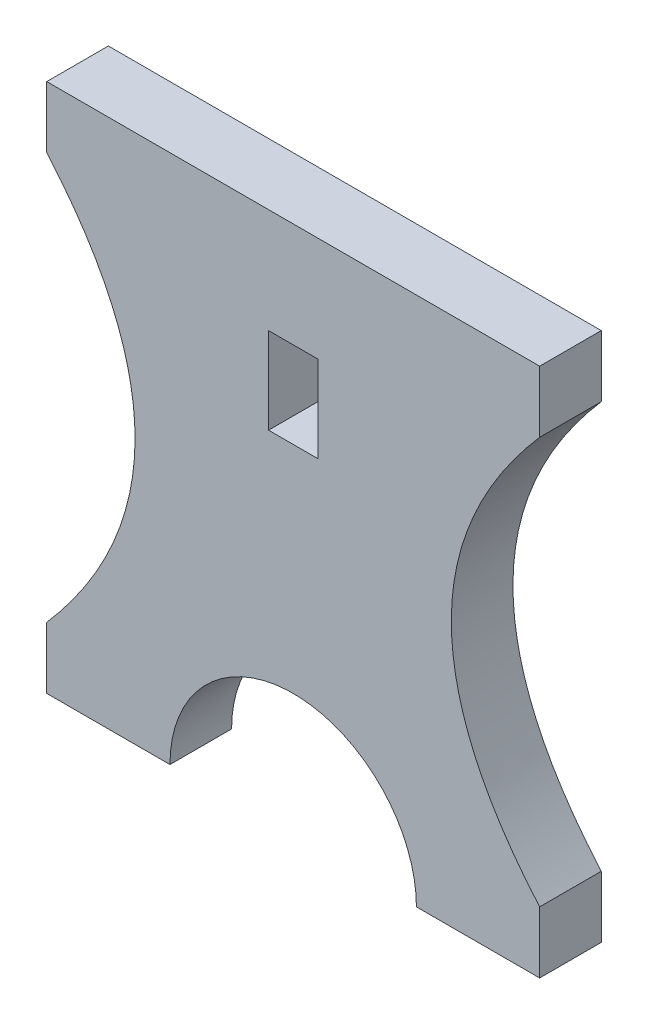
ISO-10303-21;
HEADER;
FILE_DESCRIPTION(('STEP AP214'),'2;1');
FILE_NAME('part.step','',(''),(''),'','','');
FILE_SCHEMA(('AUTOMOTIVE_DESIGN { 1 0 10303 214 1 1 1 1 }'));
ENDSEC;
DATA;
#1=APPLICATION_CONTEXT('core data for automotive mechanical design processes');
#2=APPLICATION_PROTOCOL_DEFINITION('international standard','automotive_design',2000,#1);
#3=PRODUCT_CONTEXT('',#1,'mechanical');
#4=PRODUCT('Part','Part','',(#3));
#5=PRODUCT_RELATED_PRODUCT_CATEGORY('part','',(#4));
#6=PRODUCT_DEFINITION_FORMATION('','',#4);
#7=PRODUCT_DEFINITION_CONTEXT('part definition',#1,'design');
#8=PRODUCT_DEFINITION('design','',#6,#7);
#9=PRODUCT_DEFINITION_SHAPE('','',#8);
#10=(LENGTH_UNIT() NAMED_UNIT(*) SI_UNIT(.MILLI.,.METRE.));
#11=(NAMED_UNIT(*) PLANE_ANGLE_UNIT() SI_UNIT($,.RADIAN.));
#12=(NAMED_UNIT(*) SI_UNIT($,.STERADIAN.) SOLID_ANGLE_UNIT());
#13=UNCERTAINTY_MEASURE_WITH_UNIT(LENGTH_MEASURE(1.E-05),#10,'distance_accuracy_value','');
#14=(GEOMETRIC_REPRESENTATION_CONTEXT(3) GLOBAL_UNCERTAINTY_ASSIGNED_CONTEXT((#13)) GLOBAL_UNIT_ASSIGNED_CONTEXT((#10,
#11,#12)) REPRESENTATION_CONTEXT('',''));
#15=CARTESIAN_POINT('',(0.,0.,0.));
#16=DIRECTION('',(0.,0.,1.));
#17=DIRECTION('',(1.,0.,0.));
#18=AXIS2_PLACEMENT_3D('',#15,#16,#17);
#19=CARTESIAN_POINT('',(-128.329007953853,0.,50.));
#20=DIRECTION('',(0.,0.,1.));
#21=DIRECTION('',(1.,0.,0.));
#22=AXIS2_PLACEMENT_3D('',#19,#20,#21);
#23=PLANE('',#22);
#24=DIRECTION('',(0.,-1.,0.));
#25=VECTOR('',#24,1.);
#26=CARTESIAN_POINT('',(-200.,215.,50.));
#27=LINE('',#26,#25);
#28=CARTESIAN_POINT('',(-200.,215.,50.));
#29=VERTEX_POINT('',#28);
#30=CARTESIAN_POINT('',(-200.,165.,50.));
#31=VERTEX_POINT('',#30);
#32=EDGE_CURVE('E170',#29,#31,#27,.T.);
#33=ORIENTED_EDGE('',*,*,#32,.T.);
#34=CARTESIAN_POINT('',(-200.,165.,50.));
#35=CARTESIAN_POINT('',(-56.6580159077061,0.,50.));
#36=CARTESIAN_POINT('',(-200.,-165.,50.));
#37=B_SPLINE_CURVE_WITH_KNOTS('',2,(#34,#35,#36),.UNSPECIFIED.,.F.,.F.,(3,3),(0.,1.),.UNSPECIFIED.);
#38=CARTESIAN_POINT('',(-200.,-165.,50.));
#39=VERTEX_POINT('',#38);
#40=EDGE_CURVE('E173',#31,#39,#37,.T.);
#41=ORIENTED_EDGE('',*,*,#40,.T.);
#42=DIRECTION('',(0.,-1.,0.));
#43=VECTOR('',#42,1.);
#44=CARTESIAN_POINT('',(-200.,-215.,50.));
#45=LINE('',#44,#43);
#46=CARTESIAN_POINT('',(-200.,-215.,50.));
#47=VERTEX_POINT('',#46);
#48=EDGE_CURVE('E179',#39,#47,#45,.T.);
#49=ORIENTED_EDGE('',*,*,#48,.T.);
#50=DIRECTION('',(1.,0.,0.));
#51=VECTOR('',#50,1.);
#52=CARTESIAN_POINT('',(-99.9999999999999,-215.,50.));
#53=LINE('',#52,#51);
#54=CARTESIAN_POINT('',(-99.9999999999999,-215.,50.));
#55=VERTEX_POINT('',#54);
#56=EDGE_CURVE('E303',#47,#55,#53,.T.);
#57=ORIENTED_EDGE('',*,*,#56,.T.);
#58=CARTESIAN_POINT('',(0.,-215.,50.));
#59=DIRECTION('',(0.,0.,-1.));
#60=DIRECTION('',(1.,0.,0.));
#61=AXIS2_PLACEMENT_3D('',#58,#59,#60);
#62=CIRCLE('',#61,100.);
#63=CARTESIAN_POINT('',(100.,-215.,50.));
#64=VERTEX_POINT('',#63);
#65=EDGE_CURVE('E299',#55,#64,#62,.T.);
#66=ORIENTED_EDGE('',*,*,#65,.T.);
#67=DIRECTION('',(1.,0.,0.));
#68=VECTOR('',#67,1.);
#69=CARTESIAN_POINT('',(200.,-215.,50.));
#70=LINE('',#69,#68);
#71=CARTESIAN_POINT('',(200.,-215.,50.));
#72=VERTEX_POINT('',#71);
#73=EDGE_CURVE('E302',#64,#72,#70,.T.);
#74=ORIENTED_EDGE('',*,*,#73,.T.);
#75=DIRECTION('',(0.,1.,0.));
#76=VECTOR('',#75,1.);
#77=CARTESIAN_POINT('',(200.,-215.,50.));
#78=LINE('',#77,#76);
#79=CARTESIAN_POINT('',(200.,-165.,50.));
#80=VERTEX_POINT('',#79);
#81=EDGE_CURVE('E222',#72,#80,#78,.T.);
#82=ORIENTED_EDGE('',*,*,#81,.T.);
#83=CARTESIAN_POINT('',(200.,-165.,50.));
#84=CARTESIAN_POINT('',(56.6580159077061,0.,50.));
#85=CARTESIAN_POINT('',(200.,165.,50.));
#86=B_SPLINE_CURVE_WITH_KNOTS('',2,(#83,#84,#85),.UNSPECIFIED.,.F.,.F.,(3,3),(0.,1.),.UNSPECIFIED.);
#87=CARTESIAN_POINT('',(200.,165.,50.));
#88=VERTEX_POINT('',#87);
#89=EDGE_CURVE('E215',#80,#88,#86,.T.);
#90=ORIENTED_EDGE('',*,*,#89,.T.);
#91=DIRECTION('',(0.,1.,0.));
#92=VECTOR('',#91,1.);
#93=CARTESIAN_POINT('',(200.,165.,50.));
#94=LINE('',#93,#92);
#95=CARTESIAN_POINT('',(200.,215.,50.));
#96=VERTEX_POINT('',#95);
#97=EDGE_CURVE('E221',#88,#96,#94,.T.);
#98=ORIENTED_EDGE('',*,*,#97,.T.);
#99=DIRECTION('',(-1.,0.,0.));
#100=VECTOR('',#99,1.);
#101=CARTESIAN_POINT('',(0.,215.,50.));
#102=LINE('',#101,#100);
#103=EDGE_CURVE('E228',#96,#29,#102,.T.);
#104=ORIENTED_EDGE('',*,*,#103,.T.);
#105=EDGE_LOOP('',(#33,#41,#49,#57,#66,#74,#82,#90,#98,#104));
#106=FACE_BOUND('',#105,.T.);
#107=DIRECTION('',(-1.,0.,0.));
#108=VECTOR('',#107,1.);
#109=CARTESIAN_POINT('',(-20.,130.,50.));
#110=LINE('',#109,#108);
#111=CARTESIAN_POINT('',(20.,130.,50.));
#112=VERTEX_POINT('',#111);
#113=CARTESIAN_POINT('',(-20.,130.,50.));
#114=VERTEX_POINT('',#113);
#115=EDGE_CURVE('E142',#112,#114,#110,.T.);
#116=ORIENTED_EDGE('',*,*,#115,.F.);
#117=DIRECTION('',(0.,1.,0.));
#118=VECTOR('',#117,1.);
#119=CARTESIAN_POINT('',(20.,130.,50.));
#120=LINE('',#119,#118);
#121=CARTESIAN_POINT('',(20.,60.,50.));
#122=VERTEX_POINT('',#121);
#123=EDGE_CURVE('E134',#122,#112,#120,.T.);
#124=ORIENTED_EDGE('',*,*,#123,.F.);
#125=DIRECTION('',(1.,0.,0.));
#126=VECTOR('',#125,1.);
#127=CARTESIAN_POINT('',(-20.,60.,50.));
#128=LINE('',#127,#126);
#129=CARTESIAN_POINT('',(-20.,60.,50.));
#130=VERTEX_POINT('',#129);
#131=EDGE_CURVE('E156',#130,#122,#128,.T.);
#132=ORIENTED_EDGE('',*,*,#131,.F.);
#133=DIRECTION('',(0.,-1.,0.));
#134=VECTOR('',#133,1.);
#135=CARTESIAN_POINT('',(-20.,130.,50.));
#136=LINE('',#135,#134);
#137=EDGE_CURVE('E154',#114,#130,#136,.T.);
#138=ORIENTED_EDGE('',*,*,#137,.F.);
#139=EDGE_LOOP('',(#116,#124,#132,#138));
#140=FACE_BOUND('',#139,.T.);
#141=ADVANCED_FACE('F33',(#106,#140),#23,.T.);
#142=CARTESIAN_POINT('',(-128.329007953853,0.,0.));
#143=DIRECTION('',(0.,0.,1.));
#144=DIRECTION('',(1.,0.,0.));
#145=AXIS2_PLACEMENT_3D('',#142,#143,#144);
#146=PLANE('',#145);
#147=DIRECTION('',(0.,-1.,0.));
#148=VECTOR('',#147,1.);
#149=CARTESIAN_POINT('',(-200.,215.,0.));
#150=LINE('',#149,#148);
#151=CARTESIAN_POINT('',(-200.,215.,0.));
#152=VERTEX_POINT('',#151);
#153=CARTESIAN_POINT('',(-200.,165.,0.));
#154=VERTEX_POINT('',#153);
#155=EDGE_CURVE('E150',#152,#154,#150,.T.);
#156=ORIENTED_EDGE('',*,*,#155,.F.);
#157=DIRECTION('',(-1.,0.,0.));
#158=VECTOR('',#157,1.);
#159=CARTESIAN_POINT('',(-200.,215.,0.));
#160=LINE('',#159,#158);
#161=CARTESIAN_POINT('',(200.,215.,0.));
#162=VERTEX_POINT('',#161);
#163=EDGE_CURVE('E174',#162,#152,#160,.T.);
#164=ORIENTED_EDGE('',*,*,#163,.F.);
#165=DIRECTION('',(0.,1.,0.));
#166=VECTOR('',#165,1.);
#167=CARTESIAN_POINT('',(200.,165.,0.));
#168=LINE('',#167,#166);
#169=CARTESIAN_POINT('',(200.,165.,0.));
#170=VERTEX_POINT('',#169);
#171=EDGE_CURVE('E254',#170,#162,#168,.T.);
#172=ORIENTED_EDGE('',*,*,#171,.F.);
#173=CARTESIAN_POINT('',(200.,-165.,0.));
#174=CARTESIAN_POINT('',(56.6580159077061,0.,0.));
#175=CARTESIAN_POINT('',(200.,165.,0.));
#176=B_SPLINE_CURVE_WITH_KNOTS('',2,(#173,#174,#175),.UNSPECIFIED.,.F.,.F.,(3,3),(0.,1.),.UNSPECIFIED.);
#177=CARTESIAN_POINT('',(200.,-165.,0.));
#178=VERTEX_POINT('',#177);
#179=EDGE_CURVE('E250',#178,#170,#176,.T.);
#180=ORIENTED_EDGE('',*,*,#179,.F.);
#181=DIRECTION('',(0.,1.,0.));
#182=VECTOR('',#181,1.);
#183=CARTESIAN_POINT('',(200.,-215.,0.));
#184=LINE('',#183,#182);
#185=CARTESIAN_POINT('',(200.,-215.,0.));
#186=VERTEX_POINT('',#185);
#187=EDGE_CURVE('E248',#186,#178,#184,.T.);
#188=ORIENTED_EDGE('',*,*,#187,.F.);
#189=DIRECTION('',(1.,0.,0.));
#190=VECTOR('',#189,1.);
#191=CARTESIAN_POINT('',(200.,-215.,0.));
#192=LINE('',#191,#190);
#193=CARTESIAN_POINT('',(100.,-215.,0.));
#194=VERTEX_POINT('',#193);
#195=EDGE_CURVE('E246',#194,#186,#192,.T.);
#196=ORIENTED_EDGE('',*,*,#195,.F.);
#197=CARTESIAN_POINT('',(0.,-215.,0.));
#198=DIRECTION('',(0.,0.,-1.));
#199=DIRECTION('',(1.,0.,0.));
#200=AXIS2_PLACEMENT_3D('',#197,#198,#199);
#201=CIRCLE('',#200,100.);
#202=CARTESIAN_POINT('',(-99.9999999999999,-215.,0.));
#203=VERTEX_POINT('',#202);
#204=EDGE_CURVE('E244',#203,#194,#201,.T.);
#205=ORIENTED_EDGE('',*,*,#204,.F.);
#206=DIRECTION('',(1.,0.,0.));
#207=VECTOR('',#206,1.);
#208=CARTESIAN_POINT('',(-99.9999999999999,-215.,0.));
#209=LINE('',#208,#207);
#210=CARTESIAN_POINT('',(-200.,-215.,0.));
#211=VERTEX_POINT('',#210);
#212=EDGE_CURVE('E242',#211,#203,#209,.T.);
#213=ORIENTED_EDGE('',*,*,#212,.F.);
#214=DIRECTION('',(0.,-1.,0.));
#215=VECTOR('',#214,1.);
#216=CARTESIAN_POINT('',(-200.,-215.,0.));
#217=LINE('',#216,#215);
#218=CARTESIAN_POINT('',(-200.,-165.,0.));
#219=VERTEX_POINT('',#218);
#220=EDGE_CURVE('E237',#219,#211,#217,.T.);
#221=ORIENTED_EDGE('',*,*,#220,.F.);
#222=CARTESIAN_POINT('',(-200.,165.,0.));
#223=CARTESIAN_POINT('',(-56.6580159077061,0.,0.));
#224=CARTESIAN_POINT('',(-200.,-165.,0.));
#225=B_SPLINE_CURVE_WITH_KNOTS('',2,(#222,#223,#224),.UNSPECIFIED.,.F.,.F.,(3,3),(0.,1.),.UNSPECIFIED.);
#226=EDGE_CURVE('E233',#154,#219,#225,.T.);
#227=ORIENTED_EDGE('',*,*,#226,.F.);
#228=EDGE_LOOP('',(#156,#164,#172,#180,#188,#196,#205,#213,#221,#227));
#229=FACE_BOUND('',#228,.T.);
#230=DIRECTION('',(0.,1.,0.));
#231=VECTOR('',#230,1.);
#232=CARTESIAN_POINT('',(20.,130.,0.));
#233=LINE('',#232,#231);
#234=CARTESIAN_POINT('',(20.,60.,0.));
#235=VERTEX_POINT('',#234);
#236=CARTESIAN_POINT('',(20.,130.,0.));
#237=VERTEX_POINT('',#236);
#238=EDGE_CURVE('E56',#235,#237,#233,.T.);
#239=ORIENTED_EDGE('',*,*,#238,.T.);
#240=DIRECTION('',(-1.,0.,0.));
#241=VECTOR('',#240,1.);
#242=CARTESIAN_POINT('',(-20.,130.,0.));
#243=LINE('',#242,#241);
#244=CARTESIAN_POINT('',(-20.,130.,0.));
#245=VERTEX_POINT('',#244);
#246=EDGE_CURVE('E149',#237,#245,#243,.T.);
#247=ORIENTED_EDGE('',*,*,#246,.T.);
#248=DIRECTION('',(0.,-1.,0.));
#249=VECTOR('',#248,1.);
#250=CARTESIAN_POINT('',(-20.,130.,0.));
#251=LINE('',#250,#249);
#252=CARTESIAN_POINT('',(-20.,60.,0.));
#253=VERTEX_POINT('',#252);
#254=EDGE_CURVE('E162',#245,#253,#251,.T.);
#255=ORIENTED_EDGE('',*,*,#254,.T.);
#256=DIRECTION('',(1.,0.,0.));
#257=VECTOR('',#256,1.);
#258=CARTESIAN_POINT('',(-20.,60.,0.));
#259=LINE('',#258,#257);
#260=EDGE_CURVE('E143',#253,#235,#259,.T.);
#261=ORIENTED_EDGE('',*,*,#260,.T.);
#262=EDGE_LOOP('',(#239,#247,#255,#261));
#263=FACE_BOUND('',#262,.T.);
#264=ADVANCED_FACE('F291',(#229,#263),#146,.F.);
#265=CARTESIAN_POINT('',(-200.,215.,50.));
#266=DIRECTION('',(1.,0.,0.));
#267=DIRECTION('',(0.,0.,-1.));
#268=AXIS2_PLACEMENT_3D('',#265,#266,#267);
#269=PLANE('',#268);
#270=ORIENTED_EDGE('',*,*,#155,.T.);
#271=DIRECTION('',(0.,0.,-1.));
#272=VECTOR('',#271,1.);
#273=CARTESIAN_POINT('',(-200.,165.,50.));
#274=LINE('',#273,#272);
#275=EDGE_CURVE('E11',#31,#154,#274,.T.);
#276=ORIENTED_EDGE('',*,*,#275,.F.);
#277=ORIENTED_EDGE('',*,*,#32,.F.);
#278=DIRECTION('',(0.,0.,-1.));
#279=VECTOR('',#278,1.);
#280=CARTESIAN_POINT('',(-200.,215.,50.));
#281=LINE('',#280,#279);
#282=EDGE_CURVE('E230',#29,#152,#281,.T.);
#283=ORIENTED_EDGE('',*,*,#282,.T.);
#284=EDGE_LOOP('',(#270,#276,#277,#283));
#285=FACE_BOUND('',#284,.T.);
#286=ADVANCED_FACE('F35',(#285),#269,.F.);
#287=DIRECTION('',(0.,0.,-1.));
#288=VECTOR('',#287,1.);
#289=SURFACE_OF_LINEAR_EXTRUSION('',#37,#288);
#290=ORIENTED_EDGE('',*,*,#226,.T.);
#291=DIRECTION('',(0.,0.,-1.));
#292=VECTOR('',#291,1.);
#293=CARTESIAN_POINT('',(-200.,-165.,50.));
#294=LINE('',#293,#292);
#295=EDGE_CURVE('E41',#39,#219,#294,.T.);
#296=ORIENTED_EDGE('',*,*,#295,.F.);
#297=ORIENTED_EDGE('',*,*,#40,.F.);
#298=ORIENTED_EDGE('',*,*,#275,.T.);
#299=EDGE_LOOP('',(#290,#296,#297,#298));
#300=FACE_BOUND('',#299,.T.);
#301=ADVANCED_FACE('F184',(#300),#289,.F.);
#302=CARTESIAN_POINT('',(-200.,-215.,50.));
#303=DIRECTION('',(1.,0.,0.));
#304=DIRECTION('',(0.,1.,0.));
#305=AXIS2_PLACEMENT_3D('',#302,#303,#304);
#306=PLANE('',#305);
#307=ORIENTED_EDGE('',*,*,#220,.T.);
#308=DIRECTION('',(0.,0.,-1.));
#309=VECTOR('',#308,1.);
#310=CARTESIAN_POINT('',(-200.,-215.,50.));
#311=LINE('',#310,#309);
#312=EDGE_CURVE('E281',#47,#211,#311,.T.);
#313=ORIENTED_EDGE('',*,*,#312,.F.);
#314=ORIENTED_EDGE('',*,*,#48,.F.);
#315=ORIENTED_EDGE('',*,*,#295,.T.);
#316=EDGE_LOOP('',(#307,#313,#314,#315));
#317=FACE_BOUND('',#316,.T.);
#318=ADVANCED_FACE('F187',(#317),#306,.F.);
#319=CARTESIAN_POINT('',(-99.9999999999999,-215.,50.));
#320=DIRECTION('',(0.,1.,0.));
#321=DIRECTION('',(0.,0.,1.));
#322=AXIS2_PLACEMENT_3D('',#319,#320,#321);
#323=PLANE('',#322);
#324=ORIENTED_EDGE('',*,*,#212,.T.);
#325=DIRECTION('',(0.,0.,-1.));
#326=VECTOR('',#325,1.);
#327=CARTESIAN_POINT('',(-99.9999999999999,-215.,50.));
#328=LINE('',#327,#326);
#329=EDGE_CURVE('E278',#55,#203,#328,.T.);
#330=ORIENTED_EDGE('',*,*,#329,.F.);
#331=ORIENTED_EDGE('',*,*,#56,.F.);
#332=ORIENTED_EDGE('',*,*,#312,.T.);
#333=EDGE_LOOP('',(#324,#330,#331,#332));
#334=FACE_BOUND('',#333,.T.);
#335=ADVANCED_FACE('F191',(#334),#323,.F.);
#336=CARTESIAN_POINT('',(0.,-215.,50.));
#337=DIRECTION('',(0.,0.,-1.));
#338=DIRECTION('',(-1.,0.,0.));
#339=AXIS2_PLACEMENT_3D('',#336,#337,#338);
#340=CYLINDRICAL_SURFACE('',#339,100.);
#341=ORIENTED_EDGE('',*,*,#204,.T.);
#342=DIRECTION('',(0.,0.,-1.));
#343=VECTOR('',#342,1.);
#344=CARTESIAN_POINT('',(100.,-215.,50.));
#345=LINE('',#344,#343);
#346=EDGE_CURVE('E275',#64,#194,#345,.T.);
#347=ORIENTED_EDGE('',*,*,#346,.F.);
#348=ORIENTED_EDGE('',*,*,#65,.F.);
#349=ORIENTED_EDGE('',*,*,#329,.T.);
#350=EDGE_LOOP('',(#341,#347,#348,#349));
#351=FACE_BOUND('',#350,.T.);
#352=ADVANCED_FACE('F195',(#351),#340,.F.);
#353=CARTESIAN_POINT('',(200.,-215.,50.));
#354=DIRECTION('',(0.,1.,0.));
#355=DIRECTION('',(0.,0.,1.));
#356=AXIS2_PLACEMENT_3D('',#353,#354,#355);
#357=PLANE('',#356);
#358=ORIENTED_EDGE('',*,*,#195,.T.);
#359=DIRECTION('',(0.,0.,-1.));
#360=VECTOR('',#359,1.);
#361=CARTESIAN_POINT('',(200.,-215.,50.));
#362=LINE('',#361,#360);
#363=EDGE_CURVE('E272',#72,#186,#362,.T.);
#364=ORIENTED_EDGE('',*,*,#363,.F.);
#365=ORIENTED_EDGE('',*,*,#73,.F.);
#366=ORIENTED_EDGE('',*,*,#346,.T.);
#367=EDGE_LOOP('',(#358,#364,#365,#366));
#368=FACE_BOUND('',#367,.T.);
#369=ADVANCED_FACE('F199',(#368),#357,.F.);
#370=CARTESIAN_POINT('',(200.,-215.,50.));
#371=DIRECTION('',(-1.,0.,0.));
#372=DIRECTION('',(0.,-1.,0.));
#373=AXIS2_PLACEMENT_3D('',#370,#371,#372);
#374=PLANE('',#373);
#375=ORIENTED_EDGE('',*,*,#187,.T.);
#376=DIRECTION('',(0.,0.,-1.));
#377=VECTOR('',#376,1.);
#378=CARTESIAN_POINT('',(200.,-165.,50.));
#379=LINE('',#378,#377);
#380=EDGE_CURVE('E269',#80,#178,#379,.T.);
#381=ORIENTED_EDGE('',*,*,#380,.F.);
#382=ORIENTED_EDGE('',*,*,#81,.F.);
#383=ORIENTED_EDGE('',*,*,#363,.T.);
#384=EDGE_LOOP('',(#375,#381,#382,#383));
#385=FACE_BOUND('',#384,.T.);
#386=ADVANCED_FACE('F203',(#385),#374,.F.);
#387=DIRECTION('',(0.,0.,-1.));
#388=VECTOR('',#387,1.);
#389=SURFACE_OF_LINEAR_EXTRUSION('',#86,#388);
#390=ORIENTED_EDGE('',*,*,#179,.T.);
#391=DIRECTION('',(0.,0.,-1.));
#392=VECTOR('',#391,1.);
#393=CARTESIAN_POINT('',(200.,165.,50.));
#394=LINE('',#393,#392);
#395=EDGE_CURVE('E266',#88,#170,#394,.T.);
#396=ORIENTED_EDGE('',*,*,#395,.F.);
#397=ORIENTED_EDGE('',*,*,#89,.F.);
#398=ORIENTED_EDGE('',*,*,#380,.T.);
#399=EDGE_LOOP('',(#390,#396,#397,#398));
#400=FACE_BOUND('',#399,.T.);
#401=ADVANCED_FACE('F207',(#400),#389,.F.);
#402=CARTESIAN_POINT('',(200.,165.,50.));
#403=DIRECTION('',(-1.,0.,0.));
#404=DIRECTION('',(0.,-1.,0.));
#405=AXIS2_PLACEMENT_3D('',#402,#403,#404);
#406=PLANE('',#405);
#407=ORIENTED_EDGE('',*,*,#171,.T.);
#408=DIRECTION('',(0.,0.,-1.));
#409=VECTOR('',#408,1.);
#410=CARTESIAN_POINT('',(200.,215.,50.));
#411=LINE('',#410,#409);
#412=EDGE_CURVE('E263',#96,#162,#411,.T.);
#413=ORIENTED_EDGE('',*,*,#412,.F.);
#414=ORIENTED_EDGE('',*,*,#97,.F.);
#415=ORIENTED_EDGE('',*,*,#395,.T.);
#416=EDGE_LOOP('',(#407,#413,#414,#415));
#417=FACE_BOUND('',#416,.T.);
#418=ADVANCED_FACE('F212',(#417),#406,.F.);
#419=CARTESIAN_POINT('',(-200.,215.,50.));
#420=DIRECTION('',(0.,-1.,0.));
#421=DIRECTION('',(0.,0.,-1.));
#422=AXIS2_PLACEMENT_3D('',#419,#420,#421);
#423=PLANE('',#422);
#424=ORIENTED_EDGE('',*,*,#163,.T.);
#425=ORIENTED_EDGE('',*,*,#282,.F.);
#426=ORIENTED_EDGE('',*,*,#103,.F.);
#427=ORIENTED_EDGE('',*,*,#412,.T.);
#428=EDGE_LOOP('',(#424,#425,#426,#427));
#429=FACE_BOUND('',#428,.T.);
#430=ADVANCED_FACE('F317',(#429),#423,.F.);
#431=CARTESIAN_POINT('',(20.,130.,50.));
#432=DIRECTION('',(-1.,0.,0.));
#433=DIRECTION('',(0.,-1.,0.));
#434=AXIS2_PLACEMENT_3D('',#431,#432,#433);
#435=PLANE('',#434);
#436=ORIENTED_EDGE('',*,*,#238,.F.);
#437=DIRECTION('',(0.,0.,-1.));
#438=VECTOR('',#437,1.);
#439=CARTESIAN_POINT('',(20.,60.,50.));
#440=LINE('',#439,#438);
#441=EDGE_CURVE('E138',#122,#235,#440,.T.);
#442=ORIENTED_EDGE('',*,*,#441,.F.);
#443=ORIENTED_EDGE('',*,*,#123,.T.);
#444=DIRECTION('',(0.,0.,-1.));
#445=VECTOR('',#444,1.);
#446=CARTESIAN_POINT('',(20.,130.,50.));
#447=LINE('',#446,#445);
#448=EDGE_CURVE('E137',#112,#237,#447,.T.);
#449=ORIENTED_EDGE('',*,*,#448,.T.);
#450=EDGE_LOOP('',(#436,#442,#443,#449));
#451=FACE_BOUND('',#450,.T.);
#452=ADVANCED_FACE('F136',(#451),#435,.T.);
#453=CARTESIAN_POINT('',(-20.,130.,50.));
#454=DIRECTION('',(0.,-1.,0.));
#455=DIRECTION('',(0.,0.,-1.));
#456=AXIS2_PLACEMENT_3D('',#453,#454,#455);
#457=PLANE('',#456);
#458=ORIENTED_EDGE('',*,*,#246,.F.);
#459=ORIENTED_EDGE('',*,*,#448,.F.);
#460=ORIENTED_EDGE('',*,*,#115,.T.);
#461=DIRECTION('',(0.,0.,-1.));
#462=VECTOR('',#461,1.);
#463=CARTESIAN_POINT('',(-20.,130.,50.));
#464=LINE('',#463,#462);
#465=EDGE_CURVE('E151',#114,#245,#464,.T.);
#466=ORIENTED_EDGE('',*,*,#465,.T.);
#467=EDGE_LOOP('',(#458,#459,#460,#466));
#468=FACE_BOUND('',#467,.T.);
#469=ADVANCED_FACE('F146',(#468),#457,.T.);
#470=CARTESIAN_POINT('',(-20.,130.,50.));
#471=DIRECTION('',(1.,0.,0.));
#472=DIRECTION('',(0.,1.,0.));
#473=AXIS2_PLACEMENT_3D('',#470,#471,#472);
#474=PLANE('',#473);
#475=ORIENTED_EDGE('',*,*,#254,.F.);
#476=ORIENTED_EDGE('',*,*,#465,.F.);
#477=ORIENTED_EDGE('',*,*,#137,.T.);
#478=DIRECTION('',(0.,0.,-1.));
#479=VECTOR('',#478,1.);
#480=CARTESIAN_POINT('',(-20.,60.,50.));
#481=LINE('',#480,#479);
#482=EDGE_CURVE('E48',#130,#253,#481,.T.);
#483=ORIENTED_EDGE('',*,*,#482,.T.);
#484=EDGE_LOOP('',(#475,#476,#477,#483));
#485=FACE_BOUND('',#484,.T.);
#486=ADVANCED_FACE('F338',(#485),#474,.T.);
#487=CARTESIAN_POINT('',(-20.,60.,50.));
#488=DIRECTION('',(0.,1.,0.));
#489=DIRECTION('',(0.,0.,1.));
#490=AXIS2_PLACEMENT_3D('',#487,#488,#489);
#491=PLANE('',#490);
#492=ORIENTED_EDGE('',*,*,#260,.F.);
#493=ORIENTED_EDGE('',*,*,#482,.F.);
#494=ORIENTED_EDGE('',*,*,#131,.T.);
#495=ORIENTED_EDGE('',*,*,#441,.T.);
#496=EDGE_LOOP('',(#492,#493,#494,#495));
#497=FACE_BOUND('',#496,.T.);
#498=ADVANCED_FACE('F341',(#497),#491,.T.);
#499=CLOSED_SHELL('',(#141,#264,#286,#301,#318,#335,#352,#369,#386,#401,#418,#430,#452,#469,
#486,#498));
#500=MANIFOLD_SOLID_BREP('B2',#499);
#501=ADVANCED_BREP_SHAPE_REPRESENTATION('',(#18,#500),#14);
#502=SHAPE_DEFINITION_REPRESENTATION(#9,#501);
ENDSEC;
END-ISO-10303-21;
